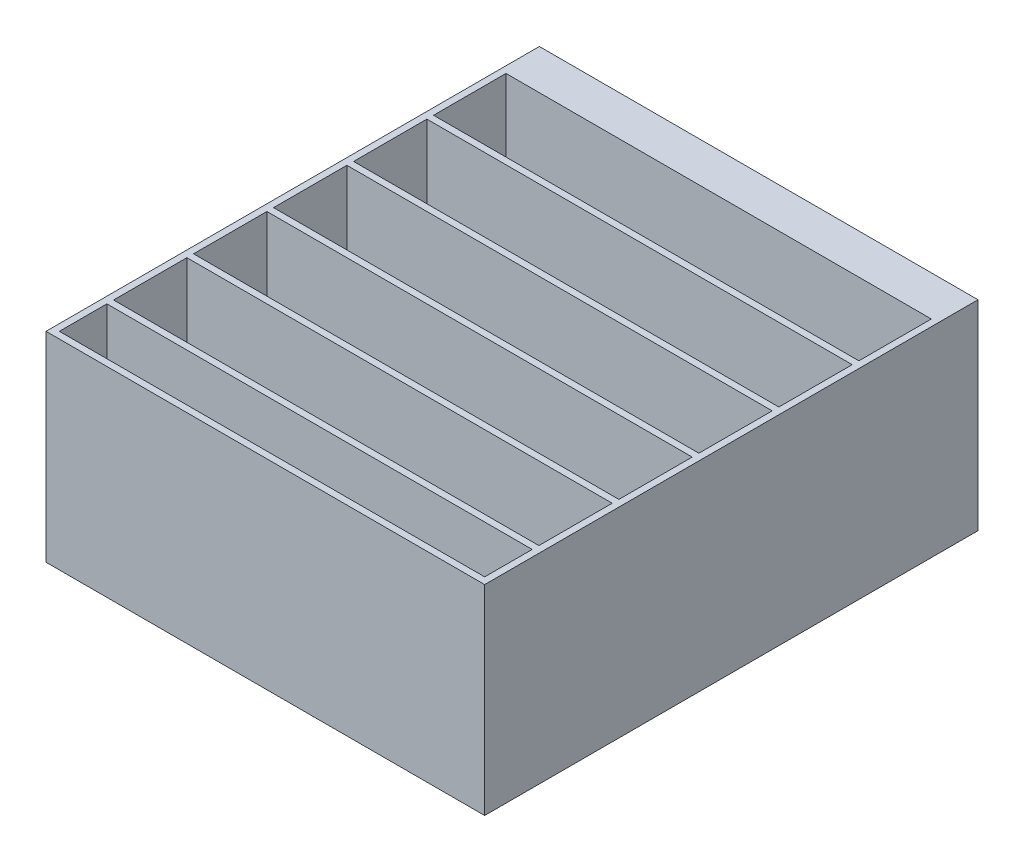
ISO-10303-21;
HEADER;
FILE_DESCRIPTION(('STEP AP214'),'2;1');
FILE_NAME('part.step','',(''),(''),'','','');
FILE_SCHEMA(('AUTOMOTIVE_DESIGN { 1 0 10303 214 1 1 1 1 }'));
ENDSEC;
DATA;
#1=APPLICATION_CONTEXT('core data for automotive mechanical design processes');
#2=APPLICATION_PROTOCOL_DEFINITION('international standard','automotive_design',2000,#1);
#3=PRODUCT_CONTEXT('',#1,'mechanical');
#4=PRODUCT('Part','Part','',(#3));
#5=PRODUCT_RELATED_PRODUCT_CATEGORY('part','',(#4));
#6=PRODUCT_DEFINITION_FORMATION('','',#4);
#7=PRODUCT_DEFINITION_CONTEXT('part definition',#1,'design');
#8=PRODUCT_DEFINITION('design','',#6,#7);
#9=PRODUCT_DEFINITION_SHAPE('','',#8);
#10=(LENGTH_UNIT() NAMED_UNIT(*) SI_UNIT(.MILLI.,.METRE.));
#11=(NAMED_UNIT(*) PLANE_ANGLE_UNIT() SI_UNIT($,.RADIAN.));
#12=(NAMED_UNIT(*) SI_UNIT($,.STERADIAN.) SOLID_ANGLE_UNIT());
#13=UNCERTAINTY_MEASURE_WITH_UNIT(LENGTH_MEASURE(1.E-05),#10,'distance_accuracy_value','');
#14=(GEOMETRIC_REPRESENTATION_CONTEXT(3) GLOBAL_UNCERTAINTY_ASSIGNED_CONTEXT((#13)) GLOBAL_UNIT_ASSIGNED_CONTEXT((#10,
#11,#12)) REPRESENTATION_CONTEXT('',''));
#15=CARTESIAN_POINT('',(0.,0.,0.));
#16=DIRECTION('',(0.,0.,1.));
#17=DIRECTION('',(1.,0.,0.));
#18=AXIS2_PLACEMENT_3D('',#15,#16,#17);
#19=CARTESIAN_POINT('',(-103.678343949045,-66.7595541401274,30.));
#20=DIRECTION('',(-1.,0.,0.));
#21=DIRECTION('',(0.,0.,1.));
#22=AXIS2_PLACEMENT_3D('',#19,#20,#21);
#23=PLANE('',#22);
#24=DIRECTION('',(0.,0.,1.));
#25=VECTOR('',#24,1.);
#26=CARTESIAN_POINT('',(-103.678343949045,-66.7595541401274,30.));
#27=LINE('',#26,#25);
#28=CARTESIAN_POINT('',(-103.678343949045,-66.7595541401274,329.339910945855));
#29=VERTEX_POINT('',#28);
#30=CARTESIAN_POINT('',(-103.678343949045,-66.7595541401274,365.));
#31=VERTEX_POINT('',#30);
#32=EDGE_CURVE('E280',#29,#31,#27,.T.);
#33=ORIENTED_EDGE('',*,*,#32,.F.);
#34=DIRECTION('',(0.,1.,0.));
#35=VECTOR('',#34,1.);
#36=CARTESIAN_POINT('',(-103.678343949045,-66.7595541401274,329.339910945855));
#37=LINE('',#36,#35);
#38=CARTESIAN_POINT('',(-103.678343949045,23.2404458598726,329.339910945854));
#39=VERTEX_POINT('',#38);
#40=EDGE_CURVE('E53',#29,#39,#37,.T.);
#41=ORIENTED_EDGE('',*,*,#40,.T.);
#42=DIRECTION('',(0.,0.,1.));
#43=VECTOR('',#42,1.);
#44=CARTESIAN_POINT('',(-103.678343949045,23.2404458598726,30.));
#45=LINE('',#44,#43);
#46=CARTESIAN_POINT('',(-103.678343949045,23.2404458598726,365.));
#47=VERTEX_POINT('',#46);
#48=EDGE_CURVE('E371',#39,#47,#45,.T.);
#49=ORIENTED_EDGE('',*,*,#48,.T.);
#50=DIRECTION('',(0.,1.,0.));
#51=VECTOR('',#50,1.);
#52=CARTESIAN_POINT('',(-103.678343949045,-66.7595541401274,365.));
#53=LINE('',#52,#51);
#54=EDGE_CURVE('E348',#31,#47,#53,.T.);
#55=ORIENTED_EDGE('',*,*,#54,.F.);
#56=EDGE_LOOP('',(#33,#41,#49,#55));
#57=FACE_BOUND('',#56,.T.);
#58=ADVANCED_FACE('F38',(#57),#23,.F.);
#59=CARTESIAN_POINT('',(215.321656050955,-66.7595541401274,30.));
#60=DIRECTION('',(1.,0.,0.));
#61=DIRECTION('',(0.,0.,-1.));
#62=AXIS2_PLACEMENT_3D('',#59,#60,#61);
#63=PLANE('',#62);
#64=DIRECTION('',(0.,0.,-1.));
#65=VECTOR('',#64,1.);
#66=CARTESIAN_POINT('',(215.321656050955,23.2404458598726,30.));
#67=LINE('',#66,#65);
#68=CARTESIAN_POINT('',(215.321656050955,23.2404458598726,365.));
#69=VERTEX_POINT('',#68);
#70=CARTESIAN_POINT('',(215.321656050955,23.2404458598726,329.339910945854));
#71=VERTEX_POINT('',#70);
#72=EDGE_CURVE('E361',#69,#71,#67,.T.);
#73=ORIENTED_EDGE('',*,*,#72,.T.);
#74=DIRECTION('',(0.,-1.,0.));
#75=VECTOR('',#74,1.);
#76=CARTESIAN_POINT('',(215.321656050955,-66.7595541401274,329.339910945855));
#77=LINE('',#76,#75);
#78=CARTESIAN_POINT('',(215.321656050955,-66.7595541401274,329.339910945855));
#79=VERTEX_POINT('',#78);
#80=EDGE_CURVE('E287',#71,#79,#77,.T.);
#81=ORIENTED_EDGE('',*,*,#80,.T.);
#82=DIRECTION('',(0.,0.,-1.));
#83=VECTOR('',#82,1.);
#84=CARTESIAN_POINT('',(215.321656050955,-66.7595541401274,30.));
#85=LINE('',#84,#83);
#86=CARTESIAN_POINT('',(215.321656050955,-66.7595541401274,365.));
#87=VERTEX_POINT('',#86);
#88=EDGE_CURVE('E374',#87,#79,#85,.T.);
#89=ORIENTED_EDGE('',*,*,#88,.F.);
#90=DIRECTION('',(0.,1.,0.));
#91=VECTOR('',#90,1.);
#92=CARTESIAN_POINT('',(215.321656050955,-66.7595541401274,365.));
#93=LINE('',#92,#91);
#94=EDGE_CURVE('E351',#87,#69,#93,.T.);
#95=ORIENTED_EDGE('',*,*,#94,.T.);
#96=EDGE_LOOP('',(#73,#81,#89,#95));
#97=FACE_BOUND('',#96,.T.);
#98=ADVANCED_FACE('F575',(#97),#63,.F.);
#99=CARTESIAN_POINT('',(0.,-66.7595541401274,0.));
#100=DIRECTION('',(0.,1.,0.));
#101=DIRECTION('',(0.,0.,1.));
#102=AXIS2_PLACEMENT_3D('',#99,#100,#101);
#103=PLANE('',#102);
#104=DIRECTION('',(1.,0.,0.));
#105=VECTOR('',#104,1.);
#106=CARTESIAN_POINT('',(0.,-66.7595541401274,329.339910945855));
#107=LINE('',#106,#105);
#108=EDGE_CURVE('E11',#29,#79,#107,.T.);
#109=ORIENTED_EDGE('',*,*,#108,.F.);
#110=ORIENTED_EDGE('',*,*,#32,.T.);
#111=DIRECTION('',(1.,0.,0.));
#112=VECTOR('',#111,1.);
#113=CARTESIAN_POINT('',(-103.678343949045,-66.7595541401274,365.));
#114=LINE('',#113,#112);
#115=EDGE_CURVE('E379',#31,#87,#114,.T.);
#116=ORIENTED_EDGE('',*,*,#115,.T.);
#117=ORIENTED_EDGE('',*,*,#88,.T.);
#118=EDGE_LOOP('',(#109,#110,#116,#117));
#119=FACE_BOUND('',#118,.T.);
#120=ADVANCED_FACE('F581',(#119),#103,.T.);
#121=CARTESIAN_POINT('',(-103.678343949045,23.2404458598726,209.339910945854));
#122=VERTEX_POINT('',#121);
#123=CARTESIAN_POINT('',(-103.678343949045,23.2404458598726,264.339910945855));
#124=VERTEX_POINT('',#123);
#125=EDGE_CURVE('E631',#122,#124,#45,.T.);
#126=ORIENTED_EDGE('',*,*,#125,.T.);
#127=DIRECTION('',(0.,-1.,0.));
#128=VECTOR('',#127,1.);
#129=CARTESIAN_POINT('',(-103.678343949045,-66.7595541401274,264.339910945855));
#130=LINE('',#129,#128);
#131=CARTESIAN_POINT('',(-103.678343949045,-66.7595541401274,264.339910945855));
#132=VERTEX_POINT('',#131);
#133=EDGE_CURVE('E484',#124,#132,#130,.T.);
#134=ORIENTED_EDGE('',*,*,#133,.T.);
#135=CARTESIAN_POINT('',(-103.678343949045,-66.7595541401274,209.339910945855));
#136=VERTEX_POINT('',#135);
#137=EDGE_CURVE('E279',#136,#132,#27,.T.);
#138=ORIENTED_EDGE('',*,*,#137,.F.);
#139=DIRECTION('',(0.,1.,0.));
#140=VECTOR('',#139,1.);
#141=CARTESIAN_POINT('',(-103.678343949045,-66.7595541401273,209.339910945854));
#142=LINE('',#141,#140);
#143=EDGE_CURVE('E475',#136,#122,#142,.T.);
#144=ORIENTED_EDGE('',*,*,#143,.T.);
#145=EDGE_LOOP('',(#126,#134,#138,#144));
#146=FACE_BOUND('',#145,.T.);
#147=ADVANCED_FACE('F577',(#146),#23,.F.);
#148=CARTESIAN_POINT('',(215.321656050955,-66.7595541401274,264.339910945855));
#149=VERTEX_POINT('',#148);
#150=CARTESIAN_POINT('',(215.321656050955,-66.7595541401273,209.339910945855));
#151=VERTEX_POINT('',#150);
#152=EDGE_CURVE('E553',#149,#151,#85,.T.);
#153=ORIENTED_EDGE('',*,*,#152,.F.);
#154=DIRECTION('',(0.,1.,0.));
#155=VECTOR('',#154,1.);
#156=CARTESIAN_POINT('',(215.321656050955,-66.7595541401274,264.339910945855));
#157=LINE('',#156,#155);
#158=CARTESIAN_POINT('',(215.321656050955,23.2404458598726,264.339910945855));
#159=VERTEX_POINT('',#158);
#160=EDGE_CURVE('E488',#149,#159,#157,.T.);
#161=ORIENTED_EDGE('',*,*,#160,.T.);
#162=CARTESIAN_POINT('',(215.321656050955,23.2404458598726,209.339910945854));
#163=VERTEX_POINT('',#162);
#164=EDGE_CURVE('E515',#159,#163,#67,.T.);
#165=ORIENTED_EDGE('',*,*,#164,.T.);
#166=DIRECTION('',(0.,-1.,0.));
#167=VECTOR('',#166,1.);
#168=CARTESIAN_POINT('',(215.321656050955,-66.7595541401273,209.339910945854));
#169=LINE('',#168,#167);
#170=EDGE_CURVE('E477',#163,#151,#169,.T.);
#171=ORIENTED_EDGE('',*,*,#170,.T.);
#172=EDGE_LOOP('',(#153,#161,#165,#171));
#173=FACE_BOUND('',#172,.T.);
#174=ADVANCED_FACE('F584',(#173),#63,.F.);
#175=DIRECTION('',(-1.,0.,0.));
#176=VECTOR('',#175,1.);
#177=CARTESIAN_POINT('',(0.,-66.7595541401274,264.339910945855));
#178=LINE('',#177,#176);
#179=EDGE_CURVE('E292',#149,#132,#178,.T.);
#180=ORIENTED_EDGE('',*,*,#179,.F.);
#181=ORIENTED_EDGE('',*,*,#152,.T.);
#182=DIRECTION('',(1.,0.,0.));
#183=VECTOR('',#182,1.);
#184=CARTESIAN_POINT('',(0.,-66.7595541401274,209.339910945855));
#185=LINE('',#184,#183);
#186=EDGE_CURVE('E300',#136,#151,#185,.T.);
#187=ORIENTED_EDGE('',*,*,#186,.F.);
#188=ORIENTED_EDGE('',*,*,#137,.T.);
#189=EDGE_LOOP('',(#180,#181,#187,#188));
#190=FACE_BOUND('',#189,.T.);
#191=ADVANCED_FACE('F617',(#190),#103,.T.);
#192=CARTESIAN_POINT('',(-103.678343949045,23.2404458598726,149.339910945854));
#193=VERTEX_POINT('',#192);
#194=CARTESIAN_POINT('',(-103.678343949045,23.2404458598726,204.339910945854));
#195=VERTEX_POINT('',#194);
#196=EDGE_CURVE('E625',#193,#195,#45,.T.);
#197=ORIENTED_EDGE('',*,*,#196,.T.);
#198=DIRECTION('',(0.,-1.,0.));
#199=VECTOR('',#198,1.);
#200=CARTESIAN_POINT('',(-103.678343949045,-66.7595541401274,204.339910945854));
#201=LINE('',#200,#199);
#202=CARTESIAN_POINT('',(-103.678343949045,-66.7595541401274,204.339910945854));
#203=VERTEX_POINT('',#202);
#204=EDGE_CURVE('E469',#195,#203,#201,.T.);
#205=ORIENTED_EDGE('',*,*,#204,.T.);
#206=CARTESIAN_POINT('',(-103.678343949045,-66.7595541401274,149.339910945854));
#207=VERTEX_POINT('',#206);
#208=EDGE_CURVE('E638',#207,#203,#27,.T.);
#209=ORIENTED_EDGE('',*,*,#208,.F.);
#210=DIRECTION('',(0.,1.,0.));
#211=VECTOR('',#210,1.);
#212=CARTESIAN_POINT('',(-103.678343949045,-66.7595541401274,149.339910945854));
#213=LINE('',#212,#211);
#214=EDGE_CURVE('E460',#207,#193,#213,.T.);
#215=ORIENTED_EDGE('',*,*,#214,.T.);
#216=EDGE_LOOP('',(#197,#205,#209,#215));
#217=FACE_BOUND('',#216,.T.);
#218=ADVANCED_FACE('F589',(#217),#23,.F.);
#219=CARTESIAN_POINT('',(215.321656050955,-66.7595541401274,204.339910945854));
#220=VERTEX_POINT('',#219);
#221=CARTESIAN_POINT('',(215.321656050955,-66.7595541401274,149.339910945854));
#222=VERTEX_POINT('',#221);
#223=EDGE_CURVE('E550',#220,#222,#85,.T.);
#224=ORIENTED_EDGE('',*,*,#223,.F.);
#225=DIRECTION('',(0.,1.,0.));
#226=VECTOR('',#225,1.);
#227=CARTESIAN_POINT('',(215.321656050955,-66.7595541401274,204.339910945854));
#228=LINE('',#227,#226);
#229=CARTESIAN_POINT('',(215.321656050955,23.2404458598726,204.339910945854));
#230=VERTEX_POINT('',#229);
#231=EDGE_CURVE('E473',#220,#230,#228,.T.);
#232=ORIENTED_EDGE('',*,*,#231,.T.);
#233=CARTESIAN_POINT('',(215.321656050955,23.2404458598726,149.339910945854));
#234=VERTEX_POINT('',#233);
#235=EDGE_CURVE('E516',#230,#234,#67,.T.);
#236=ORIENTED_EDGE('',*,*,#235,.T.);
#237=DIRECTION('',(0.,-1.,0.));
#238=VECTOR('',#237,1.);
#239=CARTESIAN_POINT('',(215.321656050955,-66.7595541401274,149.339910945854));
#240=LINE('',#239,#238);
#241=EDGE_CURVE('E462',#234,#222,#240,.T.);
#242=ORIENTED_EDGE('',*,*,#241,.T.);
#243=EDGE_LOOP('',(#224,#232,#236,#242));
#244=FACE_BOUND('',#243,.T.);
#245=ADVANCED_FACE('F616',(#244),#63,.F.);
#246=DIRECTION('',(-1.,0.,0.));
#247=VECTOR('',#246,1.);
#248=CARTESIAN_POINT('',(0.,-66.7595541401274,204.339910945854));
#249=LINE('',#248,#247);
#250=EDGE_CURVE('E297',#220,#203,#249,.T.);
#251=ORIENTED_EDGE('',*,*,#250,.F.);
#252=ORIENTED_EDGE('',*,*,#223,.T.);
#253=DIRECTION('',(1.,0.,0.));
#254=VECTOR('',#253,1.);
#255=CARTESIAN_POINT('',(0.,-66.7595541401274,149.339910945854));
#256=LINE('',#255,#254);
#257=EDGE_CURVE('E306',#207,#222,#256,.T.);
#258=ORIENTED_EDGE('',*,*,#257,.F.);
#259=ORIENTED_EDGE('',*,*,#208,.T.);
#260=EDGE_LOOP('',(#251,#252,#258,#259));
#261=FACE_BOUND('',#260,.T.);
#262=ADVANCED_FACE('F609',(#261),#103,.T.);
#263=CARTESIAN_POINT('',(-103.678343949045,23.2404458598726,89.3399109458545));
#264=VERTEX_POINT('',#263);
#265=CARTESIAN_POINT('',(-103.678343949045,23.2404458598726,144.339910945854));
#266=VERTEX_POINT('',#265);
#267=EDGE_CURVE('E370',#264,#266,#45,.T.);
#268=ORIENTED_EDGE('',*,*,#267,.T.);
#269=DIRECTION('',(0.,-1.,0.));
#270=VECTOR('',#269,1.);
#271=CARTESIAN_POINT('',(-103.678343949045,-66.7595541401274,144.339910945854));
#272=LINE('',#271,#270);
#273=CARTESIAN_POINT('',(-103.678343949045,-66.7595541401274,144.339910945854));
#274=VERTEX_POINT('',#273);
#275=EDGE_CURVE('E454',#266,#274,#272,.T.);
#276=ORIENTED_EDGE('',*,*,#275,.T.);
#277=CARTESIAN_POINT('',(-103.678343949045,-66.7595541401274,89.3399109458545));
#278=VERTEX_POINT('',#277);
#279=EDGE_CURVE('E384',#278,#274,#27,.T.);
#280=ORIENTED_EDGE('',*,*,#279,.F.);
#281=DIRECTION('',(0.,1.,0.));
#282=VECTOR('',#281,1.);
#283=CARTESIAN_POINT('',(-103.678343949045,-66.7595541401274,89.3399109458545));
#284=LINE('',#283,#282);
#285=EDGE_CURVE('E445',#278,#264,#284,.T.);
#286=ORIENTED_EDGE('',*,*,#285,.T.);
#287=EDGE_LOOP('',(#268,#276,#280,#286));
#288=FACE_BOUND('',#287,.T.);
#289=ADVANCED_FACE('F602',(#288),#23,.F.);
#290=CARTESIAN_POINT('',(215.321656050955,-66.7595541401274,144.339910945854));
#291=VERTEX_POINT('',#290);
#292=CARTESIAN_POINT('',(215.321656050955,-66.7595541401273,89.3399109458545));
#293=VERTEX_POINT('',#292);
#294=EDGE_CURVE('E549',#291,#293,#85,.T.);
#295=ORIENTED_EDGE('',*,*,#294,.F.);
#296=DIRECTION('',(0.,1.,0.));
#297=VECTOR('',#296,1.);
#298=CARTESIAN_POINT('',(215.321656050955,-66.7595541401274,144.339910945854));
#299=LINE('',#298,#297);
#300=CARTESIAN_POINT('',(215.321656050955,23.2404458598726,144.339910945854));
#301=VERTEX_POINT('',#300);
#302=EDGE_CURVE('E458',#291,#301,#299,.T.);
#303=ORIENTED_EDGE('',*,*,#302,.T.);
#304=CARTESIAN_POINT('',(215.321656050955,23.2404458598726,89.3399109458545));
#305=VERTEX_POINT('',#304);
#306=EDGE_CURVE('E520',#301,#305,#67,.T.);
#307=ORIENTED_EDGE('',*,*,#306,.T.);
#308=DIRECTION('',(0.,-1.,0.));
#309=VECTOR('',#308,1.);
#310=CARTESIAN_POINT('',(215.321656050955,-66.7595541401274,89.3399109458545));
#311=LINE('',#310,#309);
#312=EDGE_CURVE('E447',#305,#293,#311,.T.);
#313=ORIENTED_EDGE('',*,*,#312,.T.);
#314=EDGE_LOOP('',(#295,#303,#307,#313));
#315=FACE_BOUND('',#314,.T.);
#316=ADVANCED_FACE('F607',(#315),#63,.F.);
#317=DIRECTION('',(-1.,0.,0.));
#318=VECTOR('',#317,1.);
#319=CARTESIAN_POINT('',(0.,-66.7595541401274,144.339910945854));
#320=LINE('',#319,#318);
#321=EDGE_CURVE('E303',#291,#274,#320,.T.);
#322=ORIENTED_EDGE('',*,*,#321,.F.);
#323=ORIENTED_EDGE('',*,*,#294,.T.);
#324=DIRECTION('',(1.,0.,0.));
#325=VECTOR('',#324,1.);
#326=CARTESIAN_POINT('',(0.,-66.7595541401274,89.3399109458545));
#327=LINE('',#326,#325);
#328=EDGE_CURVE('E312',#278,#293,#327,.T.);
#329=ORIENTED_EDGE('',*,*,#328,.F.);
#330=ORIENTED_EDGE('',*,*,#279,.T.);
#331=EDGE_LOOP('',(#322,#323,#329,#330));
#332=FACE_BOUND('',#331,.T.);
#333=ADVANCED_FACE('F601',(#332),#103,.T.);
#334=CARTESIAN_POINT('',(-103.678343949045,23.2404458598726,30.));
#335=VERTEX_POINT('',#334);
#336=CARTESIAN_POINT('',(-103.678343949045,23.2404458598726,84.3399109458545));
#337=VERTEX_POINT('',#336);
#338=EDGE_CURVE('E368',#335,#337,#45,.T.);
#339=ORIENTED_EDGE('',*,*,#338,.T.);
#340=DIRECTION('',(0.,-1.,0.));
#341=VECTOR('',#340,1.);
#342=CARTESIAN_POINT('',(-103.678343949045,-66.7595541401274,84.3399109458545));
#343=LINE('',#342,#341);
#344=CARTESIAN_POINT('',(-103.678343949045,-66.7595541401274,84.3399109458545));
#345=VERTEX_POINT('',#344);
#346=EDGE_CURVE('E433',#337,#345,#343,.T.);
#347=ORIENTED_EDGE('',*,*,#346,.T.);
#348=CARTESIAN_POINT('',(-103.678343949045,-66.7595541401274,30.));
#349=VERTEX_POINT('',#348);
#350=EDGE_CURVE('E381',#349,#345,#27,.T.);
#351=ORIENTED_EDGE('',*,*,#350,.F.);
#352=DIRECTION('',(0.,1.,0.));
#353=VECTOR('',#352,1.);
#354=CARTESIAN_POINT('',(-103.678343949045,-66.7595541401274,30.));
#355=LINE('',#354,#353);
#356=EDGE_CURVE('E340',#349,#335,#355,.T.);
#357=ORIENTED_EDGE('',*,*,#356,.T.);
#358=EDGE_LOOP('',(#339,#347,#351,#357));
#359=FACE_BOUND('',#358,.T.);
#360=ADVANCED_FACE('F543',(#359),#23,.F.);
#361=CARTESIAN_POINT('',(215.321656050955,-66.7595541401274,84.3399109458545));
#362=VERTEX_POINT('',#361);
#363=CARTESIAN_POINT('',(215.321656050955,-66.7595541401274,30.));
#364=VERTEX_POINT('',#363);
#365=EDGE_CURVE('E378',#362,#364,#85,.T.);
#366=ORIENTED_EDGE('',*,*,#365,.F.);
#367=DIRECTION('',(0.,1.,0.));
#368=VECTOR('',#367,1.);
#369=CARTESIAN_POINT('',(215.321656050955,-66.7595541401274,84.3399109458545));
#370=LINE('',#369,#368);
#371=CARTESIAN_POINT('',(215.321656050955,23.2404458598726,84.3399109458545));
#372=VERTEX_POINT('',#371);
#373=EDGE_CURVE('E443',#362,#372,#370,.T.);
#374=ORIENTED_EDGE('',*,*,#373,.T.);
#375=CARTESIAN_POINT('',(215.321656050955,23.2404458598726,30.));
#376=VERTEX_POINT('',#375);
#377=EDGE_CURVE('E364',#372,#376,#67,.T.);
#378=ORIENTED_EDGE('',*,*,#377,.T.);
#379=DIRECTION('',(0.,1.,0.));
#380=VECTOR('',#379,1.);
#381=CARTESIAN_POINT('',(215.321656050955,-66.7595541401274,30.));
#382=LINE('',#381,#380);
#383=EDGE_CURVE('E354',#364,#376,#382,.T.);
#384=ORIENTED_EDGE('',*,*,#383,.F.);
#385=EDGE_LOOP('',(#366,#374,#378,#384));
#386=FACE_BOUND('',#385,.T.);
#387=ADVANCED_FACE('F531',(#386),#63,.F.);
#388=DIRECTION('',(-1.,0.,0.));
#389=VECTOR('',#388,1.);
#390=CARTESIAN_POINT('',(0.,-66.7595541401274,84.3399109458545));
#391=LINE('',#390,#389);
#392=EDGE_CURVE('E309',#362,#345,#391,.T.);
#393=ORIENTED_EDGE('',*,*,#392,.F.);
#394=ORIENTED_EDGE('',*,*,#365,.T.);
#395=DIRECTION('',(-1.,0.,0.));
#396=VECTOR('',#395,1.);
#397=CARTESIAN_POINT('',(-103.678343949045,-66.7595541401274,30.));
#398=LINE('',#397,#396);
#399=EDGE_CURVE('E352',#364,#349,#398,.T.);
#400=ORIENTED_EDGE('',*,*,#399,.T.);
#401=ORIENTED_EDGE('',*,*,#350,.T.);
#402=EDGE_LOOP('',(#393,#394,#400,#401));
#403=FACE_BOUND('',#402,.T.);
#404=ADVANCED_FACE('F548',(#403),#103,.T.);
#405=CARTESIAN_POINT('',(-108.678343949045,23.2404458598726,370.));
#406=DIRECTION('',(1.,0.,0.));
#407=DIRECTION('',(0.,1.,0.));
#408=AXIS2_PLACEMENT_3D('',#405,#406,#407);
#409=PLANE('',#408);
#410=DIRECTION('',(0.,0.,-1.));
#411=VECTOR('',#410,1.);
#412=CARTESIAN_POINT('',(-108.678343949045,23.2404458598726,370.));
#413=LINE('',#412,#411);
#414=CARTESIAN_POINT('',(-108.678343949045,23.2404458598726,370.));
#415=VERTEX_POINT('',#414);
#416=CARTESIAN_POINT('',(-108.678343949045,23.2404458598726,0.));
#417=VERTEX_POINT('',#416);
#418=EDGE_CURVE('E323',#415,#417,#413,.T.);
#419=ORIENTED_EDGE('',*,*,#418,.T.);
#420=DIRECTION('',(0.,-1.,0.));
#421=VECTOR('',#420,1.);
#422=CARTESIAN_POINT('',(-108.678343949045,23.2404458598726,0.));
#423=LINE('',#422,#421);
#424=CARTESIAN_POINT('',(-108.678343949045,-126.759554140127,0.));
#425=VERTEX_POINT('',#424);
#426=EDGE_CURVE('E337',#417,#425,#423,.T.);
#427=ORIENTED_EDGE('',*,*,#426,.T.);
#428=DIRECTION('',(0.,0.,-1.));
#429=VECTOR('',#428,1.);
#430=CARTESIAN_POINT('',(-108.678343949045,-126.759554140127,370.));
#431=LINE('',#430,#429);
#432=CARTESIAN_POINT('',(-108.678343949045,-126.759554140127,370.));
#433=VERTEX_POINT('',#432);
#434=EDGE_CURVE('E315',#433,#425,#431,.T.);
#435=ORIENTED_EDGE('',*,*,#434,.F.);
#436=DIRECTION('',(0.,-1.,0.));
#437=VECTOR('',#436,1.);
#438=CARTESIAN_POINT('',(-108.678343949045,23.2404458598726,370.));
#439=LINE('',#438,#437);
#440=EDGE_CURVE('E329',#415,#433,#439,.T.);
#441=ORIENTED_EDGE('',*,*,#440,.F.);
#442=EDGE_LOOP('',(#419,#427,#435,#441));
#443=FACE_BOUND('',#442,.T.);
#444=ADVANCED_FACE('F40',(#443),#409,.F.);
#445=CARTESIAN_POINT('',(-108.678343949045,-126.759554140127,370.));
#446=DIRECTION('',(0.,1.,0.));
#447=DIRECTION('',(0.,0.,1.));
#448=AXIS2_PLACEMENT_3D('',#445,#446,#447);
#449=PLANE('',#448);
#450=DIRECTION('',(1.,0.,0.));
#451=VECTOR('',#450,1.);
#452=CARTESIAN_POINT('',(-108.678343949045,-126.759554140127,0.));
#453=LINE('',#452,#451);
#454=CARTESIAN_POINT('',(-48.6783439490446,-126.759554140127,0.));
#455=VERTEX_POINT('',#454);
#456=EDGE_CURVE('E333',#425,#455,#453,.T.);
#457=ORIENTED_EDGE('',*,*,#456,.T.);
#458=DIRECTION('',(0.,0.,-1.));
#459=VECTOR('',#458,1.);
#460=CARTESIAN_POINT('',(-48.6783439490446,-126.759554140127,10.7137914621154));
#461=LINE('',#460,#459);
#462=CARTESIAN_POINT('',(-48.6783439490446,-126.759554140127,10.7137914621154));
#463=VERTEX_POINT('',#462);
#464=EDGE_CURVE('E402',#463,#455,#461,.T.);
#465=ORIENTED_EDGE('',*,*,#464,.F.);
#466=DIRECTION('',(-1.,0.,0.));
#467=VECTOR('',#466,1.);
#468=CARTESIAN_POINT('',(-48.6783439490446,-126.759554140127,10.7137914621154));
#469=LINE('',#468,#467);
#470=CARTESIAN_POINT('',(160.321656050955,-126.759554140127,10.7137914621154));
#471=VERTEX_POINT('',#470);
#472=EDGE_CURVE('E395',#471,#463,#469,.T.);
#473=ORIENTED_EDGE('',*,*,#472,.F.);
#474=DIRECTION('',(0.,0.,1.));
#475=VECTOR('',#474,1.);
#476=CARTESIAN_POINT('',(160.321656050955,-126.759554140127,10.7137914621154));
#477=LINE('',#476,#475);
#478=CARTESIAN_POINT('',(160.321656050955,-126.759554140127,0.));
#479=VERTEX_POINT('',#478);
#480=EDGE_CURVE('E399',#479,#471,#477,.T.);
#481=ORIENTED_EDGE('',*,*,#480,.F.);
#482=CARTESIAN_POINT('',(220.321656050955,-126.759554140127,0.));
#483=VERTEX_POINT('',#482);
#484=EDGE_CURVE('E336',#479,#483,#453,.T.);
#485=ORIENTED_EDGE('',*,*,#484,.T.);
#486=DIRECTION('',(0.,0.,-1.));
#487=VECTOR('',#486,1.);
#488=CARTESIAN_POINT('',(220.321656050955,-126.759554140127,370.));
#489=LINE('',#488,#487);
#490=CARTESIAN_POINT('',(220.321656050955,-126.759554140127,370.));
#491=VERTEX_POINT('',#490);
#492=EDGE_CURVE('E318',#491,#483,#489,.T.);
#493=ORIENTED_EDGE('',*,*,#492,.F.);
#494=DIRECTION('',(1.,0.,0.));
#495=VECTOR('',#494,1.);
#496=CARTESIAN_POINT('',(-108.678343949045,-126.759554140127,370.));
#497=LINE('',#496,#495);
#498=EDGE_CURVE('E344',#433,#491,#497,.T.);
#499=ORIENTED_EDGE('',*,*,#498,.F.);
#500=ORIENTED_EDGE('',*,*,#434,.T.);
#501=EDGE_LOOP('',(#457,#465,#473,#481,#485,#493,#499,#500));
#502=FACE_BOUND('',#501,.T.);
#503=ADVANCED_FACE('F677',(#502),#449,.F.);
#504=CARTESIAN_POINT('',(220.321656050955,23.2404458598726,370.));
#505=DIRECTION('',(-1.,0.,0.));
#506=DIRECTION('',(0.,-1.,0.));
#507=AXIS2_PLACEMENT_3D('',#504,#505,#506);
#508=PLANE('',#507);
#509=DIRECTION('',(0.,1.,0.));
#510=VECTOR('',#509,1.);
#511=CARTESIAN_POINT('',(220.321656050955,23.2404458598726,0.));
#512=LINE('',#511,#510);
#513=CARTESIAN_POINT('',(220.321656050955,23.2404458598726,0.));
#514=VERTEX_POINT('',#513);
#515=EDGE_CURVE('E330',#483,#514,#512,.T.);
#516=ORIENTED_EDGE('',*,*,#515,.T.);
#517=DIRECTION('',(0.,0.,-1.));
#518=VECTOR('',#517,1.);
#519=CARTESIAN_POINT('',(220.321656050955,23.2404458598726,370.));
#520=LINE('',#519,#518);
#521=CARTESIAN_POINT('',(220.321656050955,23.2404458598726,370.));
#522=VERTEX_POINT('',#521);
#523=EDGE_CURVE('E321',#522,#514,#520,.T.);
#524=ORIENTED_EDGE('',*,*,#523,.F.);
#525=DIRECTION('',(0.,1.,0.));
#526=VECTOR('',#525,1.);
#527=CARTESIAN_POINT('',(220.321656050955,23.2404458598726,370.));
#528=LINE('',#527,#526);
#529=EDGE_CURVE('E342',#491,#522,#528,.T.);
#530=ORIENTED_EDGE('',*,*,#529,.F.);
#531=ORIENTED_EDGE('',*,*,#492,.T.);
#532=EDGE_LOOP('',(#516,#524,#530,#531));
#533=FACE_BOUND('',#532,.T.);
#534=ADVANCED_FACE('F682',(#533),#508,.F.);
#535=CARTESIAN_POINT('',(-108.678343949045,23.2404458598726,370.));
#536=DIRECTION('',(0.,-1.,0.));
#537=DIRECTION('',(0.,0.,-1.));
#538=AXIS2_PLACEMENT_3D('',#535,#536,#537);
#539=PLANE('',#538);
#540=DIRECTION('',(-1.,0.,0.));
#541=VECTOR('',#540,1.);
#542=CARTESIAN_POINT('',(220.321656050955,23.2404458598726,329.339910945855));
#543=LINE('',#542,#541);
#544=EDGE_CURVE('E505',#71,#39,#543,.T.);
#545=ORIENTED_EDGE('',*,*,#544,.F.);
#546=ORIENTED_EDGE('',*,*,#72,.F.);
#547=DIRECTION('',(1.,0.,0.));
#548=VECTOR('',#547,1.);
#549=CARTESIAN_POINT('',(-103.678343949045,23.2404458598726,365.));
#550=LINE('',#549,#548);
#551=EDGE_CURVE('E365',#47,#69,#550,.T.);
#552=ORIENTED_EDGE('',*,*,#551,.F.);
#553=ORIENTED_EDGE('',*,*,#48,.F.);
#554=EDGE_LOOP('',(#545,#546,#552,#553));
#555=FACE_BOUND('',#554,.T.);
#556=DIRECTION('',(-1.,0.,0.));
#557=VECTOR('',#556,1.);
#558=CARTESIAN_POINT('',(220.321656050955,23.2404458598726,324.339910945855));
#559=LINE('',#558,#557);
#560=CARTESIAN_POINT('',(215.321656050955,23.2404458598726,324.339910945854));
#561=VERTEX_POINT('',#560);
#562=CARTESIAN_POINT('',(-103.678343949045,23.2404458598726,324.339910945854));
#563=VERTEX_POINT('',#562);
#564=EDGE_CURVE('E504',#561,#563,#559,.T.);
#565=ORIENTED_EDGE('',*,*,#564,.T.);
#566=CARTESIAN_POINT('',(-103.678343949045,23.2404458598726,269.339910945855));
#567=VERTEX_POINT('',#566);
#568=EDGE_CURVE('E61',#567,#563,#45,.T.);
#569=ORIENTED_EDGE('',*,*,#568,.F.);
#570=DIRECTION('',(-1.,0.,0.));
#571=VECTOR('',#570,1.);
#572=CARTESIAN_POINT('',(220.321656050955,23.2404458598726,269.339910945855));
#573=LINE('',#572,#571);
#574=CARTESIAN_POINT('',(215.321656050955,23.2404458598726,269.339910945855));
#575=VERTEX_POINT('',#574);
#576=EDGE_CURVE('E496',#575,#567,#573,.T.);
#577=ORIENTED_EDGE('',*,*,#576,.F.);
#578=EDGE_CURVE('E363',#561,#575,#67,.T.);
#579=ORIENTED_EDGE('',*,*,#578,.F.);
#580=EDGE_LOOP('',(#565,#569,#577,#579));
#581=FACE_BOUND('',#580,.T.);
#582=DIRECTION('',(-1.,0.,0.));
#583=VECTOR('',#582,1.);
#584=CARTESIAN_POINT('',(220.321656050955,23.2404458598726,264.339910945855));
#585=LINE('',#584,#583);
#586=EDGE_CURVE('E495',#159,#124,#585,.T.);
#587=ORIENTED_EDGE('',*,*,#586,.T.);
#588=ORIENTED_EDGE('',*,*,#125,.F.);
#589=DIRECTION('',(-1.,0.,0.));
#590=VECTOR('',#589,1.);
#591=CARTESIAN_POINT('',(220.321656050955,23.2404458598726,209.339910945854));
#592=LINE('',#591,#590);
#593=EDGE_CURVE('E481',#163,#122,#592,.T.);
#594=ORIENTED_EDGE('',*,*,#593,.F.);
#595=ORIENTED_EDGE('',*,*,#164,.F.);
#596=EDGE_LOOP('',(#587,#588,#594,#595));
#597=FACE_BOUND('',#596,.T.);
#598=DIRECTION('',(-1.,0.,0.));
#599=VECTOR('',#598,1.);
#600=CARTESIAN_POINT('',(-108.678343949045,23.2404458598726,0.));
#601=LINE('',#600,#599);
#602=EDGE_CURVE('E326',#514,#417,#601,.T.);
#603=ORIENTED_EDGE('',*,*,#602,.T.);
#604=ORIENTED_EDGE('',*,*,#418,.F.);
#605=DIRECTION('',(-1.,0.,0.));
#606=VECTOR('',#605,1.);
#607=CARTESIAN_POINT('',(-108.678343949045,23.2404458598726,370.));
#608=LINE('',#607,#606);
#609=EDGE_CURVE('E325',#522,#415,#608,.T.);
#610=ORIENTED_EDGE('',*,*,#609,.F.);
#611=ORIENTED_EDGE('',*,*,#523,.T.);
#612=EDGE_LOOP('',(#603,#604,#610,#611));
#613=FACE_BOUND('',#612,.T.);
#614=DIRECTION('',(-1.,0.,0.));
#615=VECTOR('',#614,1.);
#616=CARTESIAN_POINT('',(220.321656050955,23.2404458598726,144.339910945854));
#617=LINE('',#616,#615);
#618=EDGE_CURVE('E465',#301,#266,#617,.T.);
#619=ORIENTED_EDGE('',*,*,#618,.T.);
#620=ORIENTED_EDGE('',*,*,#267,.F.);
#621=DIRECTION('',(-1.,0.,0.));
#622=VECTOR('',#621,1.);
#623=CARTESIAN_POINT('',(220.321656050955,23.2404458598726,89.3399109458545));
#624=LINE('',#623,#622);
#625=EDGE_CURVE('E451',#305,#264,#624,.T.);
#626=ORIENTED_EDGE('',*,*,#625,.F.);
#627=ORIENTED_EDGE('',*,*,#306,.F.);
#628=EDGE_LOOP('',(#619,#620,#626,#627));
#629=FACE_BOUND('',#628,.T.);
#630=DIRECTION('',(-1.,0.,0.));
#631=VECTOR('',#630,1.);
#632=CARTESIAN_POINT('',(220.321656050955,23.2404458598726,84.3399109458545));
#633=LINE('',#632,#631);
#634=EDGE_CURVE('E450',#372,#337,#633,.T.);
#635=ORIENTED_EDGE('',*,*,#634,.T.);
#636=ORIENTED_EDGE('',*,*,#338,.F.);
#637=DIRECTION('',(-1.,0.,0.));
#638=VECTOR('',#637,1.);
#639=CARTESIAN_POINT('',(-103.678343949045,23.2404458598726,30.));
#640=LINE('',#639,#638);
#641=EDGE_CURVE('E358',#376,#335,#640,.T.);
#642=ORIENTED_EDGE('',*,*,#641,.F.);
#643=ORIENTED_EDGE('',*,*,#377,.F.);
#644=EDGE_LOOP('',(#635,#636,#642,#643));
#645=FACE_BOUND('',#644,.T.);
#646=DIRECTION('',(-1.,0.,0.));
#647=VECTOR('',#646,1.);
#648=CARTESIAN_POINT('',(220.321656050955,23.2404458598726,204.339910945854));
#649=LINE('',#648,#647);
#650=EDGE_CURVE('E480',#230,#195,#649,.T.);
#651=ORIENTED_EDGE('',*,*,#650,.T.);
#652=ORIENTED_EDGE('',*,*,#196,.F.);
#653=DIRECTION('',(-1.,0.,0.));
#654=VECTOR('',#653,1.);
#655=CARTESIAN_POINT('',(220.321656050955,23.2404458598726,149.339910945854));
#656=LINE('',#655,#654);
#657=EDGE_CURVE('E466',#234,#193,#656,.T.);
#658=ORIENTED_EDGE('',*,*,#657,.F.);
#659=ORIENTED_EDGE('',*,*,#235,.F.);
#660=EDGE_LOOP('',(#651,#652,#658,#659));
#661=FACE_BOUND('',#660,.T.);
#662=ADVANCED_FACE('F510',(#555,#581,#597,#613,#629,#645,#661),#539,.F.);
#663=CARTESIAN_POINT('',(0.,0.,370.));
#664=DIRECTION('',(0.,0.,1.));
#665=DIRECTION('',(1.,0.,0.));
#666=AXIS2_PLACEMENT_3D('',#663,#664,#665);
#667=PLANE('',#666);
#668=ORIENTED_EDGE('',*,*,#440,.T.);
#669=ORIENTED_EDGE('',*,*,#498,.T.);
#670=ORIENTED_EDGE('',*,*,#529,.T.);
#671=ORIENTED_EDGE('',*,*,#609,.T.);
#672=EDGE_LOOP('',(#668,#669,#670,#671));
#673=FACE_BOUND('',#672,.T.);
#674=ADVANCED_FACE('F597',(#673),#667,.T.);
#675=CARTESIAN_POINT('',(0.,0.,0.));
#676=DIRECTION('',(0.,0.,1.));
#677=DIRECTION('',(1.,0.,0.));
#678=AXIS2_PLACEMENT_3D('',#675,#676,#677);
#679=PLANE('',#678);
#680=DIRECTION('',(1.,0.,0.));
#681=VECTOR('',#680,1.);
#682=CARTESIAN_POINT('',(-48.6783439490446,-96.7595541401274,0.));
#683=LINE('',#682,#681);
#684=CARTESIAN_POINT('',(-48.6783439490446,-96.7595541401274,0.));
#685=VERTEX_POINT('',#684);
#686=CARTESIAN_POINT('',(160.321656050955,-96.7595541401274,0.));
#687=VERTEX_POINT('',#686);
#688=EDGE_CURVE('E411',#685,#687,#683,.T.);
#689=ORIENTED_EDGE('',*,*,#688,.F.);
#690=DIRECTION('',(0.,-1.,0.));
#691=VECTOR('',#690,1.);
#692=CARTESIAN_POINT('',(-48.6783439490446,-96.7595541401274,0.));
#693=LINE('',#692,#691);
#694=EDGE_CURVE('E385',#685,#455,#693,.T.);
#695=ORIENTED_EDGE('',*,*,#694,.T.);
#696=ORIENTED_EDGE('',*,*,#456,.F.);
#697=ORIENTED_EDGE('',*,*,#426,.F.);
#698=ORIENTED_EDGE('',*,*,#602,.F.);
#699=ORIENTED_EDGE('',*,*,#515,.F.);
#700=ORIENTED_EDGE('',*,*,#484,.F.);
#701=DIRECTION('',(0.,-1.,0.));
#702=VECTOR('',#701,1.);
#703=CARTESIAN_POINT('',(160.321656050955,-96.7595541401274,0.));
#704=LINE('',#703,#702);
#705=EDGE_CURVE('E388',#687,#479,#704,.T.);
#706=ORIENTED_EDGE('',*,*,#705,.F.);
#707=EDGE_LOOP('',(#689,#695,#696,#697,#698,#699,#700,#706));
#708=FACE_BOUND('',#707,.T.);
#709=ADVANCED_FACE('F591',(#708),#679,.F.);
#710=ORIENTED_EDGE('',*,*,#568,.T.);
#711=DIRECTION('',(0.,-1.,0.));
#712=VECTOR('',#711,1.);
#713=CARTESIAN_POINT('',(-103.678343949045,-66.7595541401274,324.339910945855));
#714=LINE('',#713,#712);
#715=CARTESIAN_POINT('',(-103.678343949045,-66.7595541401274,324.339910945855));
#716=VERTEX_POINT('',#715);
#717=EDGE_CURVE('E282',#563,#716,#714,.T.);
#718=ORIENTED_EDGE('',*,*,#717,.T.);
#719=CARTESIAN_POINT('',(-103.678343949045,-66.7595541401274,269.339910945855));
#720=VERTEX_POINT('',#719);
#721=EDGE_CURVE('E272',#720,#716,#27,.T.);
#722=ORIENTED_EDGE('',*,*,#721,.F.);
#723=DIRECTION('',(0.,1.,0.));
#724=VECTOR('',#723,1.);
#725=CARTESIAN_POINT('',(-103.678343949045,-66.7595541401274,269.339910945855));
#726=LINE('',#725,#724);
#727=EDGE_CURVE('E490',#720,#567,#726,.T.);
#728=ORIENTED_EDGE('',*,*,#727,.T.);
#729=EDGE_LOOP('',(#710,#718,#722,#728));
#730=FACE_BOUND('',#729,.T.);
#731=ADVANCED_FACE('F283',(#730),#23,.F.);
#732=CARTESIAN_POINT('',(-103.678343949045,-66.7595541401274,30.));
#733=DIRECTION('',(0.,0.,-1.));
#734=DIRECTION('',(-1.,0.,0.));
#735=AXIS2_PLACEMENT_3D('',#732,#733,#734);
#736=PLANE('',#735);
#737=ORIENTED_EDGE('',*,*,#641,.T.);
#738=ORIENTED_EDGE('',*,*,#356,.F.);
#739=ORIENTED_EDGE('',*,*,#399,.F.);
#740=ORIENTED_EDGE('',*,*,#383,.T.);
#741=EDGE_LOOP('',(#737,#738,#739,#740));
#742=FACE_BOUND('',#741,.T.);
#743=ADVANCED_FACE('F538',(#742),#736,.F.);
#744=CARTESIAN_POINT('',(215.321656050955,-66.7595541401274,324.339910945855));
#745=VERTEX_POINT('',#744);
#746=CARTESIAN_POINT('',(215.321656050955,-66.7595541401273,269.339910945855));
#747=VERTEX_POINT('',#746);
#748=EDGE_CURVE('E377',#745,#747,#85,.T.);
#749=ORIENTED_EDGE('',*,*,#748,.F.);
#750=DIRECTION('',(0.,1.,0.));
#751=VECTOR('',#750,1.);
#752=CARTESIAN_POINT('',(215.321656050955,-66.7595541401274,324.339910945855));
#753=LINE('',#752,#751);
#754=EDGE_CURVE('E288',#745,#561,#753,.T.);
#755=ORIENTED_EDGE('',*,*,#754,.T.);
#756=ORIENTED_EDGE('',*,*,#578,.T.);
#757=DIRECTION('',(0.,-1.,0.));
#758=VECTOR('',#757,1.);
#759=CARTESIAN_POINT('',(215.321656050955,-66.7595541401274,269.339910945855));
#760=LINE('',#759,#758);
#761=EDGE_CURVE('E492',#575,#747,#760,.T.);
#762=ORIENTED_EDGE('',*,*,#761,.T.);
#763=EDGE_LOOP('',(#749,#755,#756,#762));
#764=FACE_BOUND('',#763,.T.);
#765=ADVANCED_FACE('F558',(#764),#63,.F.);
#766=CARTESIAN_POINT('',(-103.678343949045,-66.7595541401274,365.));
#767=DIRECTION('',(0.,0.,1.));
#768=DIRECTION('',(1.,0.,0.));
#769=AXIS2_PLACEMENT_3D('',#766,#767,#768);
#770=PLANE('',#769);
#771=ORIENTED_EDGE('',*,*,#551,.T.);
#772=ORIENTED_EDGE('',*,*,#94,.F.);
#773=ORIENTED_EDGE('',*,*,#115,.F.);
#774=ORIENTED_EDGE('',*,*,#54,.T.);
#775=EDGE_LOOP('',(#771,#772,#773,#774));
#776=FACE_BOUND('',#775,.T.);
#777=ADVANCED_FACE('F656',(#776),#770,.F.);
#778=DIRECTION('',(-1.,0.,0.));
#779=VECTOR('',#778,1.);
#780=CARTESIAN_POINT('',(0.,-66.7595541401274,324.339910945855));
#781=LINE('',#780,#779);
#782=EDGE_CURVE('E46',#745,#716,#781,.T.);
#783=ORIENTED_EDGE('',*,*,#782,.F.);
#784=ORIENTED_EDGE('',*,*,#748,.T.);
#785=DIRECTION('',(1.,0.,0.));
#786=VECTOR('',#785,1.);
#787=CARTESIAN_POINT('',(0.,-66.7595541401274,269.339910945855));
#788=LINE('',#787,#786);
#789=EDGE_CURVE('E277',#720,#747,#788,.T.);
#790=ORIENTED_EDGE('',*,*,#789,.F.);
#791=ORIENTED_EDGE('',*,*,#721,.T.);
#792=EDGE_LOOP('',(#783,#784,#790,#791));
#793=FACE_BOUND('',#792,.T.);
#794=ADVANCED_FACE('F273',(#793),#103,.T.);
#795=CARTESIAN_POINT('',(-48.6783439490446,-96.7595541401274,10.7137914621154));
#796=DIRECTION('',(-1.,0.,0.));
#797=DIRECTION('',(0.,0.,1.));
#798=AXIS2_PLACEMENT_3D('',#795,#796,#797);
#799=PLANE('',#798);
#800=ORIENTED_EDGE('',*,*,#464,.T.);
#801=ORIENTED_EDGE('',*,*,#694,.F.);
#802=DIRECTION('',(0.,0.,-1.));
#803=VECTOR('',#802,1.);
#804=CARTESIAN_POINT('',(-48.6783439490446,-96.7595541401274,10.7137914621154));
#805=LINE('',#804,#803);
#806=CARTESIAN_POINT('',(-48.6783439490446,-96.7595541401274,10.7137914621154));
#807=VERTEX_POINT('',#806);
#808=EDGE_CURVE('E398',#807,#685,#805,.T.);
#809=ORIENTED_EDGE('',*,*,#808,.F.);
#810=DIRECTION('',(0.,-1.,0.));
#811=VECTOR('',#810,1.);
#812=CARTESIAN_POINT('',(-48.6783439490446,-96.7595541401274,10.7137914621154));
#813=LINE('',#812,#811);
#814=EDGE_CURVE('E393',#807,#463,#813,.T.);
#815=ORIENTED_EDGE('',*,*,#814,.T.);
#816=EDGE_LOOP('',(#800,#801,#809,#815));
#817=FACE_BOUND('',#816,.T.);
#818=ADVANCED_FACE('F666',(#817),#799,.F.);
#819=CARTESIAN_POINT('',(-48.6783439490446,-96.7595541401274,10.7137914621154));
#820=DIRECTION('',(0.,0.,1.));
#821=DIRECTION('',(1.,0.,0.));
#822=AXIS2_PLACEMENT_3D('',#819,#820,#821);
#823=PLANE('',#822);
#824=ORIENTED_EDGE('',*,*,#472,.T.);
#825=ORIENTED_EDGE('',*,*,#814,.F.);
#826=DIRECTION('',(-1.,0.,0.));
#827=VECTOR('',#826,1.);
#828=CARTESIAN_POINT('',(-48.6783439490446,-96.7595541401274,10.7137914621154));
#829=LINE('',#828,#827);
#830=CARTESIAN_POINT('',(-48.5783439490446,-96.7595541401274,10.7137914621154));
#831=VERTEX_POINT('',#830);
#832=EDGE_CURVE('E407',#831,#807,#829,.T.);
#833=ORIENTED_EDGE('',*,*,#832,.F.);
#834=DIRECTION('',(0.,-1.,0.));
#835=VECTOR('',#834,1.);
#836=CARTESIAN_POINT('',(-48.5783439490446,-66.7595541401274,10.7137914621154));
#837=LINE('',#836,#835);
#838=CARTESIAN_POINT('',(-48.5783439490446,-66.7595541401274,10.7137914621154));
#839=VERTEX_POINT('',#838);
#840=EDGE_CURVE('E418',#839,#831,#837,.T.);
#841=ORIENTED_EDGE('',*,*,#840,.F.);
#842=DIRECTION('',(-1.,0.,0.));
#843=VECTOR('',#842,1.);
#844=CARTESIAN_POINT('',(160.221656050955,-66.7595541401274,10.7137914621154));
#845=LINE('',#844,#843);
#846=CARTESIAN_POINT('',(160.221656050955,-66.7595541401274,10.7137914621154));
#847=VERTEX_POINT('',#846);
#848=EDGE_CURVE('E438',#847,#839,#845,.T.);
#849=ORIENTED_EDGE('',*,*,#848,.F.);
#850=DIRECTION('',(0.,-1.,0.));
#851=VECTOR('',#850,1.);
#852=CARTESIAN_POINT('',(160.221656050955,-66.7595541401274,10.7137914621154));
#853=LINE('',#852,#851);
#854=CARTESIAN_POINT('',(160.221656050955,-96.7595541401274,10.7137914621154));
#855=VERTEX_POINT('',#854);
#856=EDGE_CURVE('E415',#847,#855,#853,.T.);
#857=ORIENTED_EDGE('',*,*,#856,.T.);
#858=CARTESIAN_POINT('',(160.321656050955,-96.7595541401274,10.7137914621154));
#859=VERTEX_POINT('',#858);
#860=EDGE_CURVE('E389',#859,#855,#829,.T.);
#861=ORIENTED_EDGE('',*,*,#860,.F.);
#862=DIRECTION('',(0.,-1.,0.));
#863=VECTOR('',#862,1.);
#864=CARTESIAN_POINT('',(160.321656050955,-96.7595541401274,10.7137914621154));
#865=LINE('',#864,#863);
#866=EDGE_CURVE('E391',#859,#471,#865,.T.);
#867=ORIENTED_EDGE('',*,*,#866,.T.);
#868=EDGE_LOOP('',(#824,#825,#833,#841,#849,#857,#861,#867));
#869=FACE_BOUND('',#868,.T.);
#870=ADVANCED_FACE('F671',(#869),#823,.F.);
#871=CARTESIAN_POINT('',(160.321656050955,-96.7595541401274,10.7137914621154));
#872=DIRECTION('',(1.,0.,0.));
#873=DIRECTION('',(0.,0.,-1.));
#874=AXIS2_PLACEMENT_3D('',#871,#872,#873);
#875=PLANE('',#874);
#876=ORIENTED_EDGE('',*,*,#480,.T.);
#877=ORIENTED_EDGE('',*,*,#866,.F.);
#878=DIRECTION('',(0.,0.,1.));
#879=VECTOR('',#878,1.);
#880=CARTESIAN_POINT('',(160.321656050955,-96.7595541401274,10.7137914621154));
#881=LINE('',#880,#879);
#882=EDGE_CURVE('E408',#687,#859,#881,.T.);
#883=ORIENTED_EDGE('',*,*,#882,.F.);
#884=ORIENTED_EDGE('',*,*,#705,.T.);
#885=EDGE_LOOP('',(#876,#877,#883,#884));
#886=FACE_BOUND('',#885,.T.);
#887=ADVANCED_FACE('F705',(#886),#875,.F.);
#888=CARTESIAN_POINT('',(0.,-96.7595541401274,0.));
#889=DIRECTION('',(0.,-1.,0.));
#890=DIRECTION('',(0.,0.,-1.));
#891=AXIS2_PLACEMENT_3D('',#888,#889,#890);
#892=PLANE('',#891);
#893=DIRECTION('',(0.,0.,1.));
#894=VECTOR('',#893,1.);
#895=CARTESIAN_POINT('',(160.221656050955,-96.7595541401274,2.));
#896=LINE('',#895,#894);
#897=CARTESIAN_POINT('',(160.221656050955,-96.7595541401274,2.));
#898=VERTEX_POINT('',#897);
#899=EDGE_CURVE('E431',#898,#855,#896,.T.);
#900=ORIENTED_EDGE('',*,*,#899,.F.);
#901=DIRECTION('',(1.,0.,0.));
#902=VECTOR('',#901,1.);
#903=CARTESIAN_POINT('',(160.221656050955,-96.7595541401274,2.));
#904=LINE('',#903,#902);
#905=CARTESIAN_POINT('',(-48.5783439490446,-96.7595541401274,2.));
#906=VERTEX_POINT('',#905);
#907=EDGE_CURVE('E424',#906,#898,#904,.T.);
#908=ORIENTED_EDGE('',*,*,#907,.F.);
#909=DIRECTION('',(0.,0.,-1.));
#910=VECTOR('',#909,1.);
#911=CARTESIAN_POINT('',(-48.5783439490446,-96.7595541401274,2.));
#912=LINE('',#911,#910);
#913=EDGE_CURVE('E428',#831,#906,#912,.T.);
#914=ORIENTED_EDGE('',*,*,#913,.F.);
#915=ORIENTED_EDGE('',*,*,#832,.T.);
#916=ORIENTED_EDGE('',*,*,#808,.T.);
#917=ORIENTED_EDGE('',*,*,#688,.T.);
#918=ORIENTED_EDGE('',*,*,#882,.T.);
#919=ORIENTED_EDGE('',*,*,#860,.T.);
#920=EDGE_LOOP('',(#900,#908,#914,#915,#916,#917,#918,#919));
#921=FACE_BOUND('',#920,.T.);
#922=ADVANCED_FACE('F709',(#921),#892,.T.);
#923=CARTESIAN_POINT('',(160.221656050955,-66.7595541401274,2.));
#924=DIRECTION('',(1.,0.,0.));
#925=DIRECTION('',(0.,0.,-1.));
#926=AXIS2_PLACEMENT_3D('',#923,#924,#925);
#927=PLANE('',#926);
#928=ORIENTED_EDGE('',*,*,#899,.T.);
#929=ORIENTED_EDGE('',*,*,#856,.F.);
#930=DIRECTION('',(0.,0.,1.));
#931=VECTOR('',#930,1.);
#932=CARTESIAN_POINT('',(160.221656050955,-66.7595541401274,2.));
#933=LINE('',#932,#931);
#934=CARTESIAN_POINT('',(160.221656050955,-66.7595541401274,2.));
#935=VERTEX_POINT('',#934);
#936=EDGE_CURVE('E427',#935,#847,#933,.T.);
#937=ORIENTED_EDGE('',*,*,#936,.F.);
#938=DIRECTION('',(0.,-1.,0.));
#939=VECTOR('',#938,1.);
#940=CARTESIAN_POINT('',(160.221656050955,-66.7595541401274,2.));
#941=LINE('',#940,#939);
#942=EDGE_CURVE('E404',#935,#898,#941,.T.);
#943=ORIENTED_EDGE('',*,*,#942,.T.);
#944=EDGE_LOOP('',(#928,#929,#937,#943));
#945=FACE_BOUND('',#944,.T.);
#946=ADVANCED_FACE('F718',(#945),#927,.F.);
#947=CARTESIAN_POINT('',(160.221656050955,-66.7595541401274,2.));
#948=DIRECTION('',(0.,0.,-1.));
#949=DIRECTION('',(-1.,0.,0.));
#950=AXIS2_PLACEMENT_3D('',#947,#948,#949);
#951=PLANE('',#950);
#952=ORIENTED_EDGE('',*,*,#907,.T.);
#953=ORIENTED_EDGE('',*,*,#942,.F.);
#954=DIRECTION('',(1.,0.,0.));
#955=VECTOR('',#954,1.);
#956=CARTESIAN_POINT('',(160.221656050955,-66.7595541401274,2.));
#957=LINE('',#956,#955);
#958=CARTESIAN_POINT('',(-48.5783439490446,-66.7595541401274,2.));
#959=VERTEX_POINT('',#958);
#960=EDGE_CURVE('E419',#959,#935,#957,.T.);
#961=ORIENTED_EDGE('',*,*,#960,.F.);
#962=DIRECTION('',(0.,-1.,0.));
#963=VECTOR('',#962,1.);
#964=CARTESIAN_POINT('',(-48.5783439490446,-66.7595541401274,2.));
#965=LINE('',#964,#963);
#966=EDGE_CURVE('E421',#959,#906,#965,.T.);
#967=ORIENTED_EDGE('',*,*,#966,.T.);
#968=EDGE_LOOP('',(#952,#953,#961,#967));
#969=FACE_BOUND('',#968,.T.);
#970=ADVANCED_FACE('F722',(#969),#951,.F.);
#971=CARTESIAN_POINT('',(-48.5783439490446,-66.7595541401274,2.));
#972=DIRECTION('',(-1.,0.,0.));
#973=DIRECTION('',(0.,0.,1.));
#974=AXIS2_PLACEMENT_3D('',#971,#972,#973);
#975=PLANE('',#974);
#976=ORIENTED_EDGE('',*,*,#913,.T.);
#977=ORIENTED_EDGE('',*,*,#966,.F.);
#978=DIRECTION('',(0.,0.,-1.));
#979=VECTOR('',#978,1.);
#980=CARTESIAN_POINT('',(-48.5783439490446,-66.7595541401274,2.));
#981=LINE('',#980,#979);
#982=EDGE_CURVE('E436',#839,#959,#981,.T.);
#983=ORIENTED_EDGE('',*,*,#982,.F.);
#984=ORIENTED_EDGE('',*,*,#840,.T.);
#985=EDGE_LOOP('',(#976,#977,#983,#984));
#986=FACE_BOUND('',#985,.T.);
#987=ADVANCED_FACE('F726',(#986),#975,.F.);
#988=CARTESIAN_POINT('',(0.,-66.7595541401274,0.));
#989=DIRECTION('',(0.,-1.,0.));
#990=DIRECTION('',(0.,0.,-1.));
#991=AXIS2_PLACEMENT_3D('',#988,#989,#990);
#992=PLANE('',#991);
#993=ORIENTED_EDGE('',*,*,#982,.T.);
#994=ORIENTED_EDGE('',*,*,#960,.T.);
#995=ORIENTED_EDGE('',*,*,#936,.T.);
#996=ORIENTED_EDGE('',*,*,#848,.T.);
#997=EDGE_LOOP('',(#993,#994,#995,#996));
#998=FACE_BOUND('',#997,.T.);
#999=ADVANCED_FACE('F729',(#998),#992,.T.);
#1000=CARTESIAN_POINT('',(220.321656050955,23.2404458598726,84.3399109458545));
#1001=DIRECTION('',(0.,0.,-1.));
#1002=DIRECTION('',(-1.,0.,0.));
#1003=AXIS2_PLACEMENT_3D('',#1000,#1001,#1002);
#1004=PLANE('',#1003);
#1005=ORIENTED_EDGE('',*,*,#346,.F.);
#1006=ORIENTED_EDGE('',*,*,#634,.F.);
#1007=ORIENTED_EDGE('',*,*,#373,.F.);
#1008=ORIENTED_EDGE('',*,*,#392,.T.);
#1009=EDGE_LOOP('',(#1005,#1006,#1007,#1008));
#1010=FACE_BOUND('',#1009,.T.);
#1011=ADVANCED_FACE('F546',(#1010),#1004,.T.);
#1012=CARTESIAN_POINT('',(220.321656050955,23.2404458598726,89.3399109458545));
#1013=DIRECTION('',(0.,0.,1.));
#1014=DIRECTION('',(0.,-1.,0.));
#1015=AXIS2_PLACEMENT_3D('',#1012,#1013,#1014);
#1016=PLANE('',#1015);
#1017=ORIENTED_EDGE('',*,*,#285,.F.);
#1018=ORIENTED_EDGE('',*,*,#328,.T.);
#1019=ORIENTED_EDGE('',*,*,#312,.F.);
#1020=ORIENTED_EDGE('',*,*,#625,.T.);
#1021=EDGE_LOOP('',(#1017,#1018,#1019,#1020));
#1022=FACE_BOUND('',#1021,.T.);
#1023=ADVANCED_FACE('F736',(#1022),#1016,.T.);
#1024=CARTESIAN_POINT('',(220.321656050955,23.2404458598726,144.339910945854));
#1025=DIRECTION('',(0.,0.,-1.));
#1026=DIRECTION('',(-1.,0.,0.));
#1027=AXIS2_PLACEMENT_3D('',#1024,#1025,#1026);
#1028=PLANE('',#1027);
#1029=ORIENTED_EDGE('',*,*,#275,.F.);
#1030=ORIENTED_EDGE('',*,*,#618,.F.);
#1031=ORIENTED_EDGE('',*,*,#302,.F.);
#1032=ORIENTED_EDGE('',*,*,#321,.T.);
#1033=EDGE_LOOP('',(#1029,#1030,#1031,#1032));
#1034=FACE_BOUND('',#1033,.T.);
#1035=ADVANCED_FACE('F807',(#1034),#1028,.T.);
#1036=CARTESIAN_POINT('',(220.321656050955,23.2404458598726,149.339910945854));
#1037=DIRECTION('',(0.,0.,1.));
#1038=DIRECTION('',(1.,0.,0.));
#1039=AXIS2_PLACEMENT_3D('',#1036,#1037,#1038);
#1040=PLANE('',#1039);
#1041=ORIENTED_EDGE('',*,*,#214,.F.);
#1042=ORIENTED_EDGE('',*,*,#257,.T.);
#1043=ORIENTED_EDGE('',*,*,#241,.F.);
#1044=ORIENTED_EDGE('',*,*,#657,.T.);
#1045=EDGE_LOOP('',(#1041,#1042,#1043,#1044));
#1046=FACE_BOUND('',#1045,.T.);
#1047=ADVANCED_FACE('F637',(#1046),#1040,.T.);
#1048=CARTESIAN_POINT('',(220.321656050955,23.2404458598726,204.339910945854));
#1049=DIRECTION('',(0.,0.,-1.));
#1050=DIRECTION('',(-1.,0.,0.));
#1051=AXIS2_PLACEMENT_3D('',#1048,#1049,#1050);
#1052=PLANE('',#1051);
#1053=ORIENTED_EDGE('',*,*,#204,.F.);
#1054=ORIENTED_EDGE('',*,*,#650,.F.);
#1055=ORIENTED_EDGE('',*,*,#231,.F.);
#1056=ORIENTED_EDGE('',*,*,#250,.T.);
#1057=EDGE_LOOP('',(#1053,#1054,#1055,#1056));
#1058=FACE_BOUND('',#1057,.T.);
#1059=ADVANCED_FACE('F634',(#1058),#1052,.T.);
#1060=CARTESIAN_POINT('',(220.321656050955,23.2404458598726,209.339910945854));
#1061=DIRECTION('',(0.,0.,1.));
#1062=DIRECTION('',(0.,-1.,0.));
#1063=AXIS2_PLACEMENT_3D('',#1060,#1061,#1062);
#1064=PLANE('',#1063);
#1065=ORIENTED_EDGE('',*,*,#143,.F.);
#1066=ORIENTED_EDGE('',*,*,#186,.T.);
#1067=ORIENTED_EDGE('',*,*,#170,.F.);
#1068=ORIENTED_EDGE('',*,*,#593,.T.);
#1069=EDGE_LOOP('',(#1065,#1066,#1067,#1068));
#1070=FACE_BOUND('',#1069,.T.);
#1071=ADVANCED_FACE('F571',(#1070),#1064,.T.);
#1072=CARTESIAN_POINT('',(220.321656050955,23.2404458598726,264.339910945855));
#1073=DIRECTION('',(0.,0.,-1.));
#1074=DIRECTION('',(-1.,0.,0.));
#1075=AXIS2_PLACEMENT_3D('',#1072,#1073,#1074);
#1076=PLANE('',#1075);
#1077=ORIENTED_EDGE('',*,*,#133,.F.);
#1078=ORIENTED_EDGE('',*,*,#586,.F.);
#1079=ORIENTED_EDGE('',*,*,#160,.F.);
#1080=ORIENTED_EDGE('',*,*,#179,.T.);
#1081=EDGE_LOOP('',(#1077,#1078,#1079,#1080));
#1082=FACE_BOUND('',#1081,.T.);
#1083=ADVANCED_FACE('F563',(#1082),#1076,.T.);
#1084=CARTESIAN_POINT('',(220.321656050955,23.2404458598726,269.339910945855));
#1085=DIRECTION('',(0.,0.,1.));
#1086=DIRECTION('',(1.,0.,0.));
#1087=AXIS2_PLACEMENT_3D('',#1084,#1085,#1086);
#1088=PLANE('',#1087);
#1089=ORIENTED_EDGE('',*,*,#727,.F.);
#1090=ORIENTED_EDGE('',*,*,#789,.T.);
#1091=ORIENTED_EDGE('',*,*,#761,.F.);
#1092=ORIENTED_EDGE('',*,*,#576,.T.);
#1093=EDGE_LOOP('',(#1089,#1090,#1091,#1092));
#1094=FACE_BOUND('',#1093,.T.);
#1095=ADVANCED_FACE('F560',(#1094),#1088,.T.);
#1096=CARTESIAN_POINT('',(220.321656050955,-68.6178894689697,329.339910945855));
#1097=DIRECTION('',(0.,0.,1.));
#1098=DIRECTION('',(1.,0.,0.));
#1099=AXIS2_PLACEMENT_3D('',#1096,#1097,#1098);
#1100=PLANE('',#1099);
#1101=ORIENTED_EDGE('',*,*,#40,.F.);
#1102=ORIENTED_EDGE('',*,*,#108,.T.);
#1103=ORIENTED_EDGE('',*,*,#80,.F.);
#1104=ORIENTED_EDGE('',*,*,#544,.T.);
#1105=EDGE_LOOP('',(#1101,#1102,#1103,#1104));
#1106=FACE_BOUND('',#1105,.T.);
#1107=ADVANCED_FACE('F562',(#1106),#1100,.T.);
#1108=CARTESIAN_POINT('',(220.321656050955,-68.6178894689697,324.339910945855));
#1109=DIRECTION('',(0.,0.,-1.));
#1110=DIRECTION('',(-1.,0.,0.));
#1111=AXIS2_PLACEMENT_3D('',#1108,#1109,#1110);
#1112=PLANE('',#1111);
#1113=ORIENTED_EDGE('',*,*,#717,.F.);
#1114=ORIENTED_EDGE('',*,*,#564,.F.);
#1115=ORIENTED_EDGE('',*,*,#754,.F.);
#1116=ORIENTED_EDGE('',*,*,#782,.T.);
#1117=EDGE_LOOP('',(#1113,#1114,#1115,#1116));
#1118=FACE_BOUND('',#1117,.T.);
#1119=ADVANCED_FACE('F291',(#1118),#1112,.T.);
#1120=CLOSED_SHELL('',(#58,#98,#120,#147,#174,#191,#218,#245,#262,#289,#316,#333,#360,#387,#404,
#444,#503,#534,#662,#674,#709,#731,#743,#765,#777,#794,#818,#870,#887,#922,#946,#970,#987,#999,
#1011,#1023,#1035,#1047,#1059,#1071,#1083,#1095,#1107,#1119));
#1121=MANIFOLD_SOLID_BREP('B2',#1120);
#1122=ADVANCED_BREP_SHAPE_REPRESENTATION('',(#18,#1121),#14);
#1123=SHAPE_DEFINITION_REPRESENTATION(#9,#1122);
ENDSEC;
END-ISO-10303-21;
